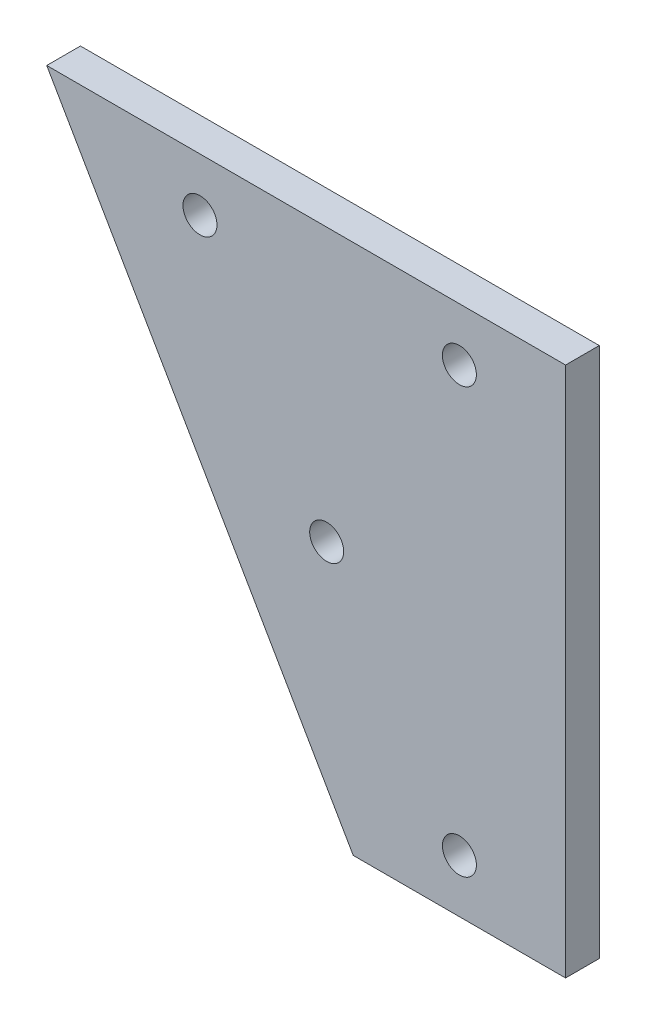
ISO-10303-21;
HEADER;
FILE_DESCRIPTION(('STEP AP214'),'2;1');
FILE_NAME('part.step','',(''),(''),'','','');
FILE_SCHEMA(('AUTOMOTIVE_DESIGN { 1 0 10303 214 1 1 1 1 }'));
ENDSEC;
DATA;
#1=APPLICATION_CONTEXT('core data for automotive mechanical design processes');
#2=APPLICATION_PROTOCOL_DEFINITION('international standard','automotive_design',2000,#1);
#3=PRODUCT_CONTEXT('',#1,'mechanical');
#4=PRODUCT('Part','Part','',(#3));
#5=PRODUCT_RELATED_PRODUCT_CATEGORY('part','',(#4));
#6=PRODUCT_DEFINITION_FORMATION('','',#4);
#7=PRODUCT_DEFINITION_CONTEXT('part definition',#1,'design');
#8=PRODUCT_DEFINITION('design','',#6,#7);
#9=PRODUCT_DEFINITION_SHAPE('','',#8);
#10=(LENGTH_UNIT() NAMED_UNIT(*) SI_UNIT(.MILLI.,.METRE.));
#11=(NAMED_UNIT(*) PLANE_ANGLE_UNIT() SI_UNIT($,.RADIAN.));
#12=(NAMED_UNIT(*) SI_UNIT($,.STERADIAN.) SOLID_ANGLE_UNIT());
#13=UNCERTAINTY_MEASURE_WITH_UNIT(LENGTH_MEASURE(1.E-05),#10,'distance_accuracy_value','');
#14=(GEOMETRIC_REPRESENTATION_CONTEXT(3) GLOBAL_UNCERTAINTY_ASSIGNED_CONTEXT((#13)) GLOBAL_UNIT_ASSIGNED_CONTEXT((#10,
#11,#12)) REPRESENTATION_CONTEXT('',''));
#15=CARTESIAN_POINT('',(0.,0.,0.));
#16=DIRECTION('',(0.,0.,1.));
#17=DIRECTION('',(1.,0.,0.));
#18=AXIS2_PLACEMENT_3D('',#15,#16,#17);
#19=CARTESIAN_POINT('',(0.,0.,3.175));
#20=DIRECTION('',(0.,0.,-1.));
#21=DIRECTION('',(-1.,0.,0.));
#22=AXIS2_PLACEMENT_3D('',#19,#20,#21);
#23=PLANE('',#22);
#24=DIRECTION('',(0.499999999999995,-0.866025403784441,0.));
#25=VECTOR('',#24,1.);
#26=CARTESIAN_POINT('',(28.8675134594809,-50.,3.175));
#27=LINE('',#26,#25);
#28=CARTESIAN_POINT('',(0.,0.,3.175));
#29=VERTEX_POINT('',#28);
#30=CARTESIAN_POINT('',(28.8675134594809,-50.,3.175));
#31=VERTEX_POINT('',#30);
#32=EDGE_CURVE('E95',#29,#31,#27,.T.);
#33=ORIENTED_EDGE('',*,*,#32,.T.);
#34=DIRECTION('',(1.,0.,0.));
#35=VECTOR('',#34,1.);
#36=CARTESIAN_POINT('',(48.8675134594809,-50.,3.175));
#37=LINE('',#36,#35);
#38=CARTESIAN_POINT('',(48.8675134594809,-50.,3.175));
#39=VERTEX_POINT('',#38);
#40=EDGE_CURVE('E90',#31,#39,#37,.T.);
#41=ORIENTED_EDGE('',*,*,#40,.T.);
#42=DIRECTION('',(0.,1.,0.));
#43=VECTOR('',#42,1.);
#44=CARTESIAN_POINT('',(48.8675134594809,0.,3.175));
#45=LINE('',#44,#43);
#46=CARTESIAN_POINT('',(48.8675134594809,0.,3.175));
#47=VERTEX_POINT('',#46);
#48=EDGE_CURVE('E93',#39,#47,#45,.T.);
#49=ORIENTED_EDGE('',*,*,#48,.T.);
#50=DIRECTION('',(-1.,0.,0.));
#51=VECTOR('',#50,1.);
#52=CARTESIAN_POINT('',(0.,0.,3.175));
#53=LINE('',#52,#51);
#54=EDGE_CURVE('E60',#47,#29,#53,.T.);
#55=ORIENTED_EDGE('',*,*,#54,.T.);
#56=EDGE_LOOP('',(#33,#41,#49,#55));
#57=FACE_BOUND('',#56,.T.);
#58=CARTESIAN_POINT('',(38.8675134594809,-5.,3.175));
#59=DIRECTION('',(0.,0.,1.));
#60=DIRECTION('',(1.,0.,0.));
#61=AXIS2_PLACEMENT_3D('',#58,#59,#60);
#62=CIRCLE('',#61,1.6);
#63=CARTESIAN_POINT('',(40.4675134594809,-5.,3.175));
#64=VERTEX_POINT('',#63);
#65=EDGE_CURVE('E110',#64,#64,#62,.T.);
#66=ORIENTED_EDGE('',*,*,#65,.F.);
#67=EDGE_LOOP('',(#66));
#68=FACE_BOUND('',#67,.T.);
#69=CARTESIAN_POINT('',(14.4337567297406,-5.,3.175));
#70=DIRECTION('',(0.,0.,1.));
#71=DIRECTION('',(1.,0.,0.));
#72=AXIS2_PLACEMENT_3D('',#69,#70,#71);
#73=CIRCLE('',#72,1.6);
#74=CARTESIAN_POINT('',(16.0337567297406,-5.,3.175));
#75=VERTEX_POINT('',#74);
#76=EDGE_CURVE('E125',#75,#75,#73,.T.);
#77=ORIENTED_EDGE('',*,*,#76,.F.);
#78=EDGE_LOOP('',(#77));
#79=FACE_BOUND('',#78,.T.);
#80=CARTESIAN_POINT('',(38.8675134594809,-45.,3.175));
#81=DIRECTION('',(0.,0.,1.));
#82=DIRECTION('',(1.,0.,0.));
#83=AXIS2_PLACEMENT_3D('',#80,#81,#82);
#84=CIRCLE('',#83,1.60000000000001);
#85=CARTESIAN_POINT('',(40.4675134594809,-45.,3.175));
#86=VERTEX_POINT('',#85);
#87=EDGE_CURVE('E131',#86,#86,#84,.T.);
#88=ORIENTED_EDGE('',*,*,#87,.F.);
#89=EDGE_LOOP('',(#88));
#90=FACE_BOUND('',#89,.T.);
#91=CARTESIAN_POINT('',(26.3675134594809,-25.6698729810776,3.175));
#92=DIRECTION('',(0.,0.,1.));
#93=DIRECTION('',(1.,0.,0.));
#94=AXIS2_PLACEMENT_3D('',#91,#92,#93);
#95=CIRCLE('',#94,1.6);
#96=CARTESIAN_POINT('',(27.9675134594809,-25.6698729810776,3.175));
#97=VERTEX_POINT('',#96);
#98=EDGE_CURVE('E137',#97,#97,#95,.T.);
#99=ORIENTED_EDGE('',*,*,#98,.F.);
#100=EDGE_LOOP('',(#99));
#101=FACE_BOUND('',#100,.T.);
#102=ADVANCED_FACE('F43',(#57,#68,#79,#90,#101),#23,.F.);
#103=CARTESIAN_POINT('',(0.,0.,0.));
#104=DIRECTION('',(0.,0.,-1.));
#105=DIRECTION('',(-1.,0.,0.));
#106=AXIS2_PLACEMENT_3D('',#103,#104,#105);
#107=PLANE('',#106);
#108=CARTESIAN_POINT('',(38.8675134594809,-45.,0.));
#109=DIRECTION('',(0.,0.,1.));
#110=DIRECTION('',(1.,0.,0.));
#111=AXIS2_PLACEMENT_3D('',#108,#109,#110);
#112=CIRCLE('',#111,1.60000000000001);
#113=CARTESIAN_POINT('',(40.4675134594809,-45.,0.));
#114=VERTEX_POINT('',#113);
#115=EDGE_CURVE('E134',#114,#114,#112,.T.);
#116=ORIENTED_EDGE('',*,*,#115,.T.);
#117=EDGE_LOOP('',(#116));
#118=FACE_BOUND('',#117,.T.);
#119=CARTESIAN_POINT('',(38.8675134594809,-5.,0.));
#120=DIRECTION('',(0.,0.,1.));
#121=DIRECTION('',(1.,0.,0.));
#122=AXIS2_PLACEMENT_3D('',#119,#120,#121);
#123=CIRCLE('',#122,1.6);
#124=CARTESIAN_POINT('',(40.4675134594809,-5.,0.));
#125=VERTEX_POINT('',#124);
#126=EDGE_CURVE('E122',#125,#125,#123,.T.);
#127=ORIENTED_EDGE('',*,*,#126,.T.);
#128=EDGE_LOOP('',(#127));
#129=FACE_BOUND('',#128,.T.);
#130=DIRECTION('',(0.499999999999995,-0.866025403784441,0.));
#131=VECTOR('',#130,1.);
#132=CARTESIAN_POINT('',(28.8675134594809,-50.,0.));
#133=LINE('',#132,#131);
#134=CARTESIAN_POINT('',(0.,0.,0.));
#135=VERTEX_POINT('',#134);
#136=CARTESIAN_POINT('',(28.8675134594809,-50.,0.));
#137=VERTEX_POINT('',#136);
#138=EDGE_CURVE('E107',#135,#137,#133,.T.);
#139=ORIENTED_EDGE('',*,*,#138,.F.);
#140=DIRECTION('',(-1.,0.,0.));
#141=VECTOR('',#140,1.);
#142=CARTESIAN_POINT('',(0.,0.,0.));
#143=LINE('',#142,#141);
#144=CARTESIAN_POINT('',(48.8675134594809,0.,0.));
#145=VERTEX_POINT('',#144);
#146=EDGE_CURVE('E83',#145,#135,#143,.T.);
#147=ORIENTED_EDGE('',*,*,#146,.F.);
#148=DIRECTION('',(0.,1.,0.));
#149=VECTOR('',#148,1.);
#150=CARTESIAN_POINT('',(48.8675134594809,0.,0.));
#151=LINE('',#150,#149);
#152=CARTESIAN_POINT('',(48.8675134594809,-50.,0.));
#153=VERTEX_POINT('',#152);
#154=EDGE_CURVE('E77',#153,#145,#151,.T.);
#155=ORIENTED_EDGE('',*,*,#154,.F.);
#156=DIRECTION('',(1.,0.,0.));
#157=VECTOR('',#156,1.);
#158=CARTESIAN_POINT('',(48.8675134594809,-50.,0.));
#159=LINE('',#158,#157);
#160=EDGE_CURVE('E99',#137,#153,#159,.T.);
#161=ORIENTED_EDGE('',*,*,#160,.F.);
#162=EDGE_LOOP('',(#139,#147,#155,#161));
#163=FACE_BOUND('',#162,.T.);
#164=CARTESIAN_POINT('',(14.4337567297406,-5.,0.));
#165=DIRECTION('',(0.,0.,1.));
#166=DIRECTION('',(1.,0.,0.));
#167=AXIS2_PLACEMENT_3D('',#164,#165,#166);
#168=CIRCLE('',#167,1.6);
#169=CARTESIAN_POINT('',(16.0337567297406,-5.,0.));
#170=VERTEX_POINT('',#169);
#171=EDGE_CURVE('E128',#170,#170,#168,.T.);
#172=ORIENTED_EDGE('',*,*,#171,.T.);
#173=EDGE_LOOP('',(#172));
#174=FACE_BOUND('',#173,.T.);
#175=CARTESIAN_POINT('',(26.3675134594809,-25.6698729810776,0.));
#176=DIRECTION('',(0.,0.,1.));
#177=DIRECTION('',(1.,0.,0.));
#178=AXIS2_PLACEMENT_3D('',#175,#176,#177);
#179=CIRCLE('',#178,1.6);
#180=CARTESIAN_POINT('',(27.9675134594809,-25.6698729810776,0.));
#181=VERTEX_POINT('',#180);
#182=EDGE_CURVE('E140',#181,#181,#179,.T.);
#183=ORIENTED_EDGE('',*,*,#182,.T.);
#184=EDGE_LOOP('',(#183));
#185=FACE_BOUND('',#184,.T.);
#186=ADVANCED_FACE('F118',(#118,#129,#163,#174,#185),#107,.T.);
#187=CARTESIAN_POINT('',(28.8675134594809,-50.,3.175));
#188=DIRECTION('',(0.866025403784441,0.499999999999995,0.));
#189=DIRECTION('',(-0.499999999999995,0.866025403784441,0.));
#190=AXIS2_PLACEMENT_3D('',#187,#188,#189);
#191=PLANE('',#190);
#192=ORIENTED_EDGE('',*,*,#138,.T.);
#193=DIRECTION('',(0.,0.,-1.));
#194=VECTOR('',#193,1.);
#195=CARTESIAN_POINT('',(28.8675134594809,-50.,3.175));
#196=LINE('',#195,#194);
#197=EDGE_CURVE('E11',#31,#137,#196,.T.);
#198=ORIENTED_EDGE('',*,*,#197,.F.);
#199=ORIENTED_EDGE('',*,*,#32,.F.);
#200=DIRECTION('',(0.,0.,-1.));
#201=VECTOR('',#200,1.);
#202=CARTESIAN_POINT('',(0.,0.,3.175));
#203=LINE('',#202,#201);
#204=EDGE_CURVE('E103',#29,#135,#203,.T.);
#205=ORIENTED_EDGE('',*,*,#204,.T.);
#206=EDGE_LOOP('',(#192,#198,#199,#205));
#207=FACE_BOUND('',#206,.T.);
#208=ADVANCED_FACE('F45',(#207),#191,.F.);
#209=CARTESIAN_POINT('',(48.8675134594809,-50.,3.175));
#210=DIRECTION('',(0.,1.,0.));
#211=DIRECTION('',(0.,0.,1.));
#212=AXIS2_PLACEMENT_3D('',#209,#210,#211);
#213=PLANE('',#212);
#214=ORIENTED_EDGE('',*,*,#160,.T.);
#215=DIRECTION('',(0.,0.,-1.));
#216=VECTOR('',#215,1.);
#217=CARTESIAN_POINT('',(48.8675134594809,-50.,3.175));
#218=LINE('',#217,#216);
#219=EDGE_CURVE('E52',#39,#153,#218,.T.);
#220=ORIENTED_EDGE('',*,*,#219,.F.);
#221=ORIENTED_EDGE('',*,*,#40,.F.);
#222=ORIENTED_EDGE('',*,*,#197,.T.);
#223=EDGE_LOOP('',(#214,#220,#221,#222));
#224=FACE_BOUND('',#223,.T.);
#225=ADVANCED_FACE('F98',(#224),#213,.F.);
#226=CARTESIAN_POINT('',(48.8675134594809,0.,3.175));
#227=DIRECTION('',(-1.,0.,0.));
#228=DIRECTION('',(0.,-1.,0.));
#229=AXIS2_PLACEMENT_3D('',#226,#227,#228);
#230=PLANE('',#229);
#231=ORIENTED_EDGE('',*,*,#154,.T.);
#232=DIRECTION('',(0.,0.,-1.));
#233=VECTOR('',#232,1.);
#234=CARTESIAN_POINT('',(48.8675134594809,0.,3.175));
#235=LINE('',#234,#233);
#236=EDGE_CURVE('E100',#47,#145,#235,.T.);
#237=ORIENTED_EDGE('',*,*,#236,.F.);
#238=ORIENTED_EDGE('',*,*,#48,.F.);
#239=ORIENTED_EDGE('',*,*,#219,.T.);
#240=EDGE_LOOP('',(#231,#237,#238,#239));
#241=FACE_BOUND('',#240,.T.);
#242=ADVANCED_FACE('F101',(#241),#230,.F.);
#243=CARTESIAN_POINT('',(0.,0.,3.175));
#244=DIRECTION('',(0.,-1.,0.));
#245=DIRECTION('',(0.,0.,-1.));
#246=AXIS2_PLACEMENT_3D('',#243,#244,#245);
#247=PLANE('',#246);
#248=ORIENTED_EDGE('',*,*,#146,.T.);
#249=ORIENTED_EDGE('',*,*,#204,.F.);
#250=ORIENTED_EDGE('',*,*,#54,.F.);
#251=ORIENTED_EDGE('',*,*,#236,.T.);
#252=EDGE_LOOP('',(#248,#249,#250,#251));
#253=FACE_BOUND('',#252,.T.);
#254=ADVANCED_FACE('F115',(#253),#247,.F.);
#255=CARTESIAN_POINT('',(38.8675134594809,-5.,3.175));
#256=DIRECTION('',(0.,0.,-1.));
#257=DIRECTION('',(-1.,0.,0.));
#258=AXIS2_PLACEMENT_3D('',#255,#256,#257);
#259=CYLINDRICAL_SURFACE('',#258,1.6);
#260=ORIENTED_EDGE('',*,*,#65,.T.);
#261=EDGE_LOOP('',(#260));
#262=FACE_BOUND('',#261,.T.);
#263=ORIENTED_EDGE('',*,*,#126,.F.);
#264=EDGE_LOOP('',(#263));
#265=FACE_BOUND('',#264,.T.);
#266=ADVANCED_FACE('F157',(#262,#265),#259,.F.);
#267=CARTESIAN_POINT('',(14.4337567297406,-5.,3.175));
#268=DIRECTION('',(0.,0.,-1.));
#269=DIRECTION('',(-1.,0.,0.));
#270=AXIS2_PLACEMENT_3D('',#267,#268,#269);
#271=CYLINDRICAL_SURFACE('',#270,1.6);
#272=ORIENTED_EDGE('',*,*,#76,.T.);
#273=EDGE_LOOP('',(#272));
#274=FACE_BOUND('',#273,.T.);
#275=ORIENTED_EDGE('',*,*,#171,.F.);
#276=EDGE_LOOP('',(#275));
#277=FACE_BOUND('',#276,.T.);
#278=ADVANCED_FACE('F202',(#274,#277),#271,.F.);
#279=CARTESIAN_POINT('',(38.8675134594809,-45.,3.175));
#280=DIRECTION('',(0.,0.,-1.));
#281=DIRECTION('',(-1.,0.,0.));
#282=AXIS2_PLACEMENT_3D('',#279,#280,#281);
#283=CYLINDRICAL_SURFACE('',#282,1.60000000000001);
#284=ORIENTED_EDGE('',*,*,#87,.T.);
#285=EDGE_LOOP('',(#284));
#286=FACE_BOUND('',#285,.T.);
#287=ORIENTED_EDGE('',*,*,#115,.F.);
#288=EDGE_LOOP('',(#287));
#289=FACE_BOUND('',#288,.T.);
#290=ADVANCED_FACE('F210',(#286,#289),#283,.F.);
#291=CARTESIAN_POINT('',(26.3675134594809,-25.6698729810776,3.175));
#292=DIRECTION('',(0.,0.,-1.));
#293=DIRECTION('',(-1.,0.,0.));
#294=AXIS2_PLACEMENT_3D('',#291,#292,#293);
#295=CYLINDRICAL_SURFACE('',#294,1.6);
#296=ORIENTED_EDGE('',*,*,#98,.T.);
#297=EDGE_LOOP('',(#296));
#298=FACE_BOUND('',#297,.T.);
#299=ORIENTED_EDGE('',*,*,#182,.F.);
#300=EDGE_LOOP('',(#299));
#301=FACE_BOUND('',#300,.T.);
#302=ADVANCED_FACE('F146',(#298,#301),#295,.F.);
#303=CLOSED_SHELL('',(#102,#186,#208,#225,#242,#254,#266,#278,#290,#302));
#304=MANIFOLD_SOLID_BREP('B2',#303);
#305=ADVANCED_BREP_SHAPE_REPRESENTATION('',(#18,#304),#14);
#306=SHAPE_DEFINITION_REPRESENTATION(#9,#305);
ENDSEC;
END-ISO-10303-21;
